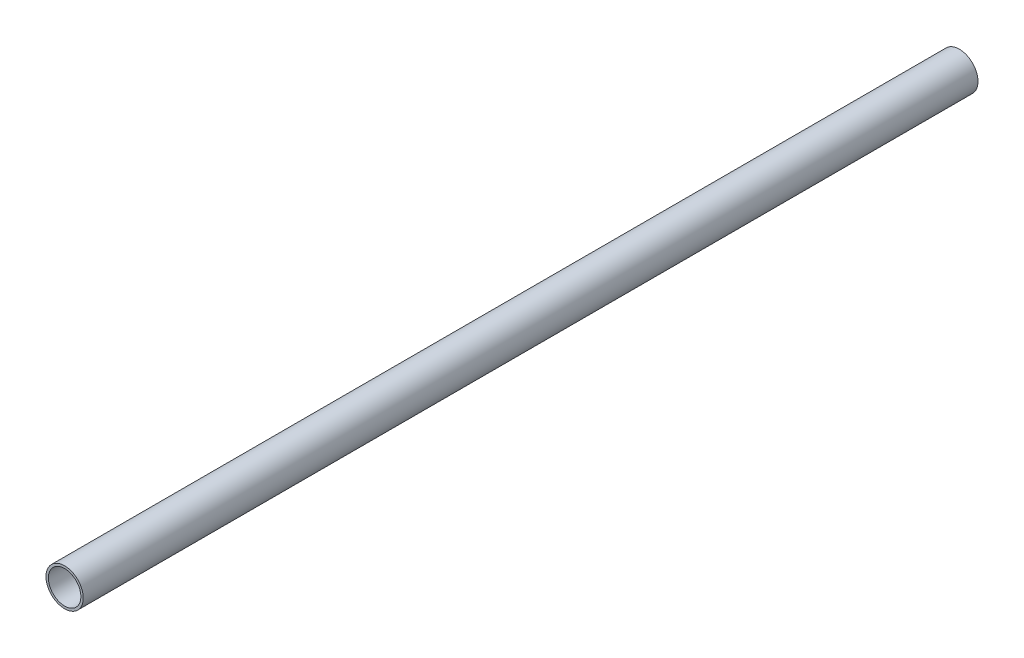
ISO-10303-21;
HEADER;
FILE_DESCRIPTION(('STEP AP214'),'2;1');
FILE_NAME('part.step','',(''),(''),'','','');
FILE_SCHEMA(('AUTOMOTIVE_DESIGN { 1 0 10303 214 1 1 1 1 }'));
ENDSEC;
DATA;
#1=APPLICATION_CONTEXT('core data for automotive mechanical design processes');
#2=APPLICATION_PROTOCOL_DEFINITION('international standard','automotive_design',2000,#1);
#3=PRODUCT_CONTEXT('',#1,'mechanical');
#4=PRODUCT('Part','Part','',(#3));
#5=PRODUCT_RELATED_PRODUCT_CATEGORY('part','',(#4));
#6=PRODUCT_DEFINITION_FORMATION('','',#4);
#7=PRODUCT_DEFINITION_CONTEXT('part definition',#1,'design');
#8=PRODUCT_DEFINITION('design','',#6,#7);
#9=PRODUCT_DEFINITION_SHAPE('','',#8);
#10=(LENGTH_UNIT() NAMED_UNIT(*) SI_UNIT(.MILLI.,.METRE.));
#11=(NAMED_UNIT(*) PLANE_ANGLE_UNIT() SI_UNIT($,.RADIAN.));
#12=(NAMED_UNIT(*) SI_UNIT($,.STERADIAN.) SOLID_ANGLE_UNIT());
#13=UNCERTAINTY_MEASURE_WITH_UNIT(LENGTH_MEASURE(1.E-05),#10,'distance_accuracy_value','');
#14=(GEOMETRIC_REPRESENTATION_CONTEXT(3) GLOBAL_UNCERTAINTY_ASSIGNED_CONTEXT((#13)) GLOBAL_UNIT_ASSIGNED_CONTEXT((#10,
#11,#12)) REPRESENTATION_CONTEXT('',''));
#15=CARTESIAN_POINT('',(0.,0.,0.));
#16=DIRECTION('',(0.,0.,1.));
#17=DIRECTION('',(1.,0.,0.));
#18=AXIS2_PLACEMENT_3D('',#15,#16,#17);
#19=CARTESIAN_POINT('',(0.,0.,152.4));
#20=DIRECTION('',(0.,0.,1.));
#21=DIRECTION('',(1.,0.,0.));
#22=AXIS2_PLACEMENT_3D('',#19,#20,#21);
#23=PLANE('',#22);
#24=CARTESIAN_POINT('',(0.,0.,152.4));
#25=DIRECTION('',(0.,0.,1.));
#26=DIRECTION('',(1.,0.,0.));
#27=AXIS2_PLACEMENT_3D('',#24,#25,#26);
#28=CIRCLE('',#27,6.35);
#29=CARTESIAN_POINT('',(6.35,0.,152.4));
#30=VERTEX_POINT('',#29);
#31=EDGE_CURVE('E10',#30,#30,#28,.T.);
#32=ORIENTED_EDGE('',*,*,#31,.T.);
#33=EDGE_LOOP('',(#32));
#34=FACE_BOUND('',#33,.T.);
#35=CARTESIAN_POINT('',(0.,0.,152.4));
#36=DIRECTION('',(0.,0.,1.));
#37=DIRECTION('',(1.,0.,0.));
#38=AXIS2_PLACEMENT_3D('',#35,#36,#37);
#39=CIRCLE('',#38,5.5372);
#40=CARTESIAN_POINT('',(5.5372,0.,152.4));
#41=VERTEX_POINT('',#40);
#42=EDGE_CURVE('E41',#41,#41,#39,.T.);
#43=ORIENTED_EDGE('',*,*,#42,.F.);
#44=EDGE_LOOP('',(#43));
#45=FACE_BOUND('',#44,.T.);
#46=ADVANCED_FACE('F30',(#34,#45),#23,.T.);
#47=CARTESIAN_POINT('',(0.,0.,-152.4));
#48=DIRECTION('',(0.,0.,1.));
#49=DIRECTION('',(1.,0.,0.));
#50=AXIS2_PLACEMENT_3D('',#47,#48,#49);
#51=PLANE('',#50);
#52=CARTESIAN_POINT('',(0.,0.,-152.4));
#53=DIRECTION('',(0.,0.,1.));
#54=DIRECTION('',(1.,0.,0.));
#55=AXIS2_PLACEMENT_3D('',#52,#53,#54);
#56=CIRCLE('',#55,6.35);
#57=CARTESIAN_POINT('',(6.35,0.,-152.4));
#58=VERTEX_POINT('',#57);
#59=EDGE_CURVE('E34',#58,#58,#56,.T.);
#60=ORIENTED_EDGE('',*,*,#59,.F.);
#61=EDGE_LOOP('',(#60));
#62=FACE_BOUND('',#61,.T.);
#63=CARTESIAN_POINT('',(0.,0.,-152.4));
#64=DIRECTION('',(0.,0.,1.));
#65=DIRECTION('',(1.,0.,0.));
#66=AXIS2_PLACEMENT_3D('',#63,#64,#65);
#67=CIRCLE('',#66,5.5372);
#68=CARTESIAN_POINT('',(5.5372,0.,-152.4));
#69=VERTEX_POINT('',#68);
#70=EDGE_CURVE('E43',#69,#69,#67,.T.);
#71=ORIENTED_EDGE('',*,*,#70,.T.);
#72=EDGE_LOOP('',(#71));
#73=FACE_BOUND('',#72,.T.);
#74=ADVANCED_FACE('F53',(#62,#73),#51,.F.);
#75=CARTESIAN_POINT('',(0.,0.,152.4));
#76=DIRECTION('',(0.,0.,-1.));
#77=DIRECTION('',(-1.,0.,0.));
#78=AXIS2_PLACEMENT_3D('',#75,#76,#77);
#79=CYLINDRICAL_SURFACE('',#78,6.35);
#80=ORIENTED_EDGE('',*,*,#31,.F.);
#81=EDGE_LOOP('',(#80));
#82=FACE_BOUND('',#81,.T.);
#83=ORIENTED_EDGE('',*,*,#59,.T.);
#84=EDGE_LOOP('',(#83));
#85=FACE_BOUND('',#84,.T.);
#86=ADVANCED_FACE('F32',(#82,#85),#79,.T.);
#87=CARTESIAN_POINT('',(0.,0.,152.4));
#88=DIRECTION('',(0.,0.,-1.));
#89=DIRECTION('',(-1.,0.,0.));
#90=AXIS2_PLACEMENT_3D('',#87,#88,#89);
#91=CYLINDRICAL_SURFACE('',#90,5.5372);
#92=ORIENTED_EDGE('',*,*,#42,.T.);
#93=EDGE_LOOP('',(#92));
#94=FACE_BOUND('',#93,.T.);
#95=ORIENTED_EDGE('',*,*,#70,.F.);
#96=EDGE_LOOP('',(#95));
#97=FACE_BOUND('',#96,.T.);
#98=ADVANCED_FACE('F49',(#94,#97),#91,.F.);
#99=CLOSED_SHELL('',(#46,#74,#86,#98));
#100=MANIFOLD_SOLID_BREP('B2',#99);
#101=ADVANCED_BREP_SHAPE_REPRESENTATION('',(#18,#100),#14);
#102=SHAPE_DEFINITION_REPRESENTATION(#9,#101);
ENDSEC;
END-ISO-10303-21;
